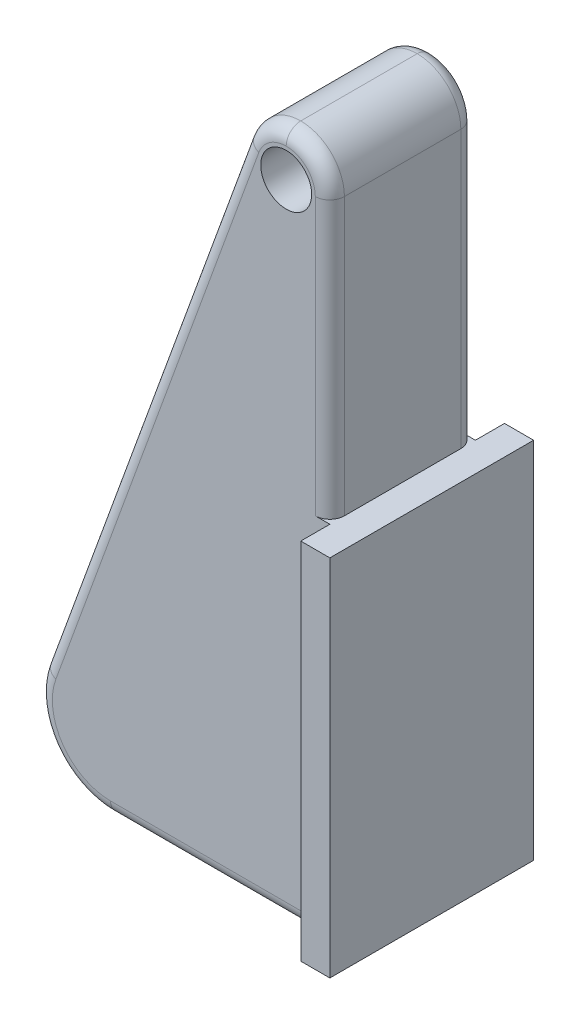
ISO-10303-21;
HEADER;
FILE_DESCRIPTION(('STEP AP214'),'2;1');
FILE_NAME('part.step','',(''),(''),'','','');
FILE_SCHEMA(('AUTOMOTIVE_DESIGN { 1 0 10303 214 1 1 1 1 }'));
ENDSEC;
DATA;
#1=APPLICATION_CONTEXT('core data for automotive mechanical design processes');
#2=APPLICATION_PROTOCOL_DEFINITION('international standard','automotive_design',2000,#1);
#3=PRODUCT_CONTEXT('',#1,'mechanical');
#4=PRODUCT('Part','Part','',(#3));
#5=PRODUCT_RELATED_PRODUCT_CATEGORY('part','',(#4));
#6=PRODUCT_DEFINITION_FORMATION('','',#4);
#7=PRODUCT_DEFINITION_CONTEXT('part definition',#1,'design');
#8=PRODUCT_DEFINITION('design','',#6,#7);
#9=PRODUCT_DEFINITION_SHAPE('','',#8);
#10=(LENGTH_UNIT() NAMED_UNIT(*) SI_UNIT(.MILLI.,.METRE.));
#11=(NAMED_UNIT(*) PLANE_ANGLE_UNIT() SI_UNIT($,.RADIAN.));
#12=(NAMED_UNIT(*) SI_UNIT($,.STERADIAN.) SOLID_ANGLE_UNIT());
#13=UNCERTAINTY_MEASURE_WITH_UNIT(LENGTH_MEASURE(1.E-05),#10,'distance_accuracy_value','');
#14=(GEOMETRIC_REPRESENTATION_CONTEXT(3) GLOBAL_UNCERTAINTY_ASSIGNED_CONTEXT((#13)) GLOBAL_UNIT_ASSIGNED_CONTEXT((#10,
#11,#12)) REPRESENTATION_CONTEXT('',''));
#15=CARTESIAN_POINT('',(0.,0.,0.));
#16=DIRECTION('',(0.,0.,1.));
#17=DIRECTION('',(1.,0.,0.));
#18=AXIS2_PLACEMENT_3D('',#15,#16,#17);
#19=CARTESIAN_POINT('',(0.,0.,10.));
#20=DIRECTION('',(-1.,0.,0.));
#21=DIRECTION('',(0.,0.,1.));
#22=AXIS2_PLACEMENT_3D('',#19,#20,#21);
#23=PLANE('',#22);
#24=DIRECTION('',(0.,0.,1.));
#25=VECTOR('',#24,1.);
#26=CARTESIAN_POINT('',(0.,25.,12.));
#27=LINE('',#26,#25);
#28=CARTESIAN_POINT('',(0.,25.,0.999999999999999));
#29=VERTEX_POINT('',#28);
#30=CARTESIAN_POINT('',(0.,25.,9.));
#31=VERTEX_POINT('',#30);
#32=EDGE_CURVE('E213',#29,#31,#27,.T.);
#33=ORIENTED_EDGE('',*,*,#32,.F.);
#34=DIRECTION('',(0.,1.,0.));
#35=VECTOR('',#34,1.);
#36=CARTESIAN_POINT('',(0.,0.,0.999999999999999));
#37=LINE('',#36,#35);
#38=CARTESIAN_POINT('',(0.,44.,0.999999999999999));
#39=VERTEX_POINT('',#38);
#40=EDGE_CURVE('E290',#29,#39,#37,.T.);
#41=ORIENTED_EDGE('',*,*,#40,.T.);
#42=DIRECTION('',(0.,0.,-1.));
#43=VECTOR('',#42,1.);
#44=CARTESIAN_POINT('',(0.,44.,10.));
#45=LINE('',#44,#43);
#46=CARTESIAN_POINT('',(0.,44.,9.));
#47=VERTEX_POINT('',#46);
#48=EDGE_CURVE('E247',#39,#47,#45,.F.);
#49=ORIENTED_EDGE('',*,*,#48,.T.);
#50=DIRECTION('',(0.,1.,0.));
#51=VECTOR('',#50,1.);
#52=CARTESIAN_POINT('',(0.,25.,9.));
#53=LINE('',#52,#51);
#54=EDGE_CURVE('E288',#47,#31,#53,.F.);
#55=ORIENTED_EDGE('',*,*,#54,.T.);
#56=EDGE_LOOP('',(#33,#41,#49,#55));
#57=FACE_BOUND('',#56,.T.);
#58=ADVANCED_FACE('F35',(#57),#23,.F.);
#59=CARTESIAN_POINT('',(0.,0.,10.));
#60=DIRECTION('',(0.,0.,1.));
#61=DIRECTION('',(1.,0.,0.));
#62=AXIS2_PLACEMENT_3D('',#59,#60,#61);
#63=PLANE('',#62);
#64=DIRECTION('',(0.,1.,0.));
#65=VECTOR('',#64,1.);
#66=CARTESIAN_POINT('',(0.,0.,10.));
#67=LINE('',#66,#65);
#68=CARTESIAN_POINT('',(0.,1.,10.));
#69=VERTEX_POINT('',#68);
#70=CARTESIAN_POINT('',(0.,25.,10.));
#71=VERTEX_POINT('',#70);
#72=EDGE_CURVE('E229',#69,#71,#67,.T.);
#73=ORIENTED_EDGE('',*,*,#72,.T.);
#74=DIRECTION('',(-1.,0.,0.));
#75=VECTOR('',#74,1.);
#76=CARTESIAN_POINT('',(2.,25.,10.));
#77=LINE('',#76,#75);
#78=CARTESIAN_POINT('',(-1.,25.,10.));
#79=VERTEX_POINT('',#78);
#80=EDGE_CURVE('E52',#71,#79,#77,.T.);
#81=ORIENTED_EDGE('',*,*,#80,.T.);
#82=DIRECTION('',(0.,1.,0.));
#83=VECTOR('',#82,1.);
#84=CARTESIAN_POINT('',(-1.,44.,10.));
#85=LINE('',#84,#83);
#86=CARTESIAN_POINT('',(-1.,44.,10.));
#87=VERTEX_POINT('',#86);
#88=EDGE_CURVE('E302',#79,#87,#85,.T.);
#89=ORIENTED_EDGE('',*,*,#88,.T.);
#90=CARTESIAN_POINT('',(-3.,44.,10.));
#91=DIRECTION('',(0.,0.,1.));
#92=DIRECTION('',(1.,0.,0.));
#93=AXIS2_PLACEMENT_3D('',#90,#91,#92);
#94=CIRCLE('',#93,2.);
#95=CARTESIAN_POINT('',(-3.,46.,10.));
#96=VERTEX_POINT('',#95);
#97=EDGE_CURVE('E300',#87,#96,#94,.T.);
#98=ORIENTED_EDGE('',*,*,#97,.T.);
#99=CARTESIAN_POINT('',(-3.,44.,10.));
#100=DIRECTION('',(0.,0.,1.));
#101=DIRECTION('',(1.,0.,0.));
#102=AXIS2_PLACEMENT_3D('',#99,#100,#101);
#103=CIRCLE('',#102,2.);
#104=CARTESIAN_POINT('',(-4.87938524157182,44.6840402866513,10.));
#105=VERTEX_POINT('',#104);
#106=EDGE_CURVE('E296',#96,#105,#103,.T.);
#107=ORIENTED_EDGE('',*,*,#106,.T.);
#108=DIRECTION('',(-0.342020143325665,-0.93969262078591,0.));
#109=VECTOR('',#108,1.);
#110=CARTESIAN_POINT('',(-18.8252540745735,6.36808057330267,10.));
#111=LINE('',#110,#109);
#112=CARTESIAN_POINT('',(-18.8252540745735,6.36808057330266,10.));
#113=VERTEX_POINT('',#112);
#114=EDGE_CURVE('E291',#105,#113,#111,.T.);
#115=ORIENTED_EDGE('',*,*,#114,.T.);
#116=CARTESIAN_POINT('',(-15.0664835914299,5.,10.));
#117=DIRECTION('',(0.,0.,1.));
#118=DIRECTION('',(1.,0.,0.));
#119=AXIS2_PLACEMENT_3D('',#116,#117,#118);
#120=CIRCLE('',#119,4.);
#121=CARTESIAN_POINT('',(-15.0664835914299,1.,10.));
#122=VERTEX_POINT('',#121);
#123=EDGE_CURVE('E294',#113,#122,#120,.T.);
#124=ORIENTED_EDGE('',*,*,#123,.T.);
#125=DIRECTION('',(1.,0.,0.));
#126=VECTOR('',#125,1.);
#127=CARTESIAN_POINT('',(0.,1.,10.));
#128=LINE('',#127,#126);
#129=EDGE_CURVE('E298',#122,#69,#128,.T.);
#130=ORIENTED_EDGE('',*,*,#129,.T.);
#131=EDGE_LOOP('',(#73,#81,#89,#98,#107,#115,#124,#130));
#132=FACE_BOUND('',#131,.T.);
#133=CARTESIAN_POINT('',(-3.,44.,10.));
#134=DIRECTION('',(0.,0.,1.));
#135=DIRECTION('',(1.,0.,0.));
#136=AXIS2_PLACEMENT_3D('',#133,#134,#135);
#137=CIRCLE('',#136,1.75);
#138=CARTESIAN_POINT('',(-1.25,44.,10.));
#139=VERTEX_POINT('',#138);
#140=EDGE_CURVE('E193',#139,#139,#137,.T.);
#141=ORIENTED_EDGE('',*,*,#140,.F.);
#142=EDGE_LOOP('',(#141));
#143=FACE_BOUND('',#142,.T.);
#144=ADVANCED_FACE('F360',(#132,#143),#63,.T.);
#145=CARTESIAN_POINT('',(0.,0.,0.));
#146=DIRECTION('',(0.,0.,1.));
#147=DIRECTION('',(1.,0.,0.));
#148=AXIS2_PLACEMENT_3D('',#145,#146,#147);
#149=PLANE('',#148);
#150=DIRECTION('',(0.,1.,0.));
#151=VECTOR('',#150,1.);
#152=CARTESIAN_POINT('',(-1.,0.,0.));
#153=LINE('',#152,#151);
#154=CARTESIAN_POINT('',(-1.,44.,0.));
#155=VERTEX_POINT('',#154);
#156=CARTESIAN_POINT('',(-1.,25.,0.));
#157=VERTEX_POINT('',#156);
#158=EDGE_CURVE('E275',#155,#157,#153,.F.);
#159=ORIENTED_EDGE('',*,*,#158,.T.);
#160=DIRECTION('',(1.,0.,0.));
#161=VECTOR('',#160,1.);
#162=CARTESIAN_POINT('',(0.,25.,0.));
#163=LINE('',#162,#161);
#164=CARTESIAN_POINT('',(0.,25.,0.));
#165=VERTEX_POINT('',#164);
#166=EDGE_CURVE('E278',#157,#165,#163,.T.);
#167=ORIENTED_EDGE('',*,*,#166,.T.);
#168=DIRECTION('',(0.,1.,0.));
#169=VECTOR('',#168,1.);
#170=CARTESIAN_POINT('',(0.,0.,0.));
#171=LINE('',#170,#169);
#172=CARTESIAN_POINT('',(0.,1.,0.));
#173=VERTEX_POINT('',#172);
#174=EDGE_CURVE('E225',#173,#165,#171,.T.);
#175=ORIENTED_EDGE('',*,*,#174,.F.);
#176=DIRECTION('',(1.,0.,0.));
#177=VECTOR('',#176,1.);
#178=CARTESIAN_POINT('',(0.,1.,0.));
#179=LINE('',#178,#177);
#180=CARTESIAN_POINT('',(-15.0664835914299,1.,0.));
#181=VERTEX_POINT('',#180);
#182=EDGE_CURVE('E269',#173,#181,#179,.F.);
#183=ORIENTED_EDGE('',*,*,#182,.T.);
#184=CARTESIAN_POINT('',(-15.0664835914299,5.,0.));
#185=DIRECTION('',(0.,0.,1.));
#186=DIRECTION('',(1.,0.,0.));
#187=AXIS2_PLACEMENT_3D('',#184,#185,#186);
#188=CIRCLE('',#187,4.);
#189=CARTESIAN_POINT('',(-18.8252540745735,6.36808057330266,0.));
#190=VERTEX_POINT('',#189);
#191=EDGE_CURVE('E262',#181,#190,#188,.F.);
#192=ORIENTED_EDGE('',*,*,#191,.T.);
#193=DIRECTION('',(-0.342020143325665,-0.93969262078591,0.));
#194=VECTOR('',#193,1.);
#195=CARTESIAN_POINT('',(-18.669779319354,6.79524395256349,0.));
#196=LINE('',#195,#194);
#197=CARTESIAN_POINT('',(-4.87938524157182,44.6840402866513,0.));
#198=VERTEX_POINT('',#197);
#199=EDGE_CURVE('E238',#190,#198,#196,.F.);
#200=ORIENTED_EDGE('',*,*,#199,.T.);
#201=CARTESIAN_POINT('',(-3.,44.,0.));
#202=DIRECTION('',(0.,0.,1.));
#203=DIRECTION('',(1.,0.,0.));
#204=AXIS2_PLACEMENT_3D('',#201,#202,#203);
#205=CIRCLE('',#204,2.);
#206=CARTESIAN_POINT('',(-3.,46.,0.));
#207=VERTEX_POINT('',#206);
#208=EDGE_CURVE('E266',#198,#207,#205,.F.);
#209=ORIENTED_EDGE('',*,*,#208,.T.);
#210=CARTESIAN_POINT('',(-3.,44.,0.));
#211=DIRECTION('',(0.,0.,1.));
#212=DIRECTION('',(1.,0.,0.));
#213=AXIS2_PLACEMENT_3D('',#210,#211,#212);
#214=CIRCLE('',#213,2.);
#215=EDGE_CURVE('E273',#207,#155,#214,.F.);
#216=ORIENTED_EDGE('',*,*,#215,.T.);
#217=EDGE_LOOP('',(#159,#167,#175,#183,#192,#200,#209,#216));
#218=FACE_BOUND('',#217,.T.);
#219=CARTESIAN_POINT('',(-3.,44.,0.));
#220=DIRECTION('',(0.,0.,1.));
#221=DIRECTION('',(1.,0.,0.));
#222=AXIS2_PLACEMENT_3D('',#219,#220,#221);
#223=CIRCLE('',#222,1.75);
#224=CARTESIAN_POINT('',(-1.25,44.,0.));
#225=VERTEX_POINT('',#224);
#226=EDGE_CURVE('E190',#225,#225,#223,.T.);
#227=ORIENTED_EDGE('',*,*,#226,.T.);
#228=EDGE_LOOP('',(#227));
#229=FACE_BOUND('',#228,.T.);
#230=ADVANCED_FACE('F433',(#218,#229),#149,.F.);
#231=CARTESIAN_POINT('',(-22.2072236251404,0.,10.));
#232=DIRECTION('',(0.,1.,0.));
#233=DIRECTION('',(-1.,0.,0.));
#234=AXIS2_PLACEMENT_3D('',#231,#232,#233);
#235=PLANE('',#234);
#236=DIRECTION('',(0.,0.,-1.));
#237=VECTOR('',#236,1.);
#238=CARTESIAN_POINT('',(0.,0.,12.));
#239=LINE('',#238,#237);
#240=CARTESIAN_POINT('',(0.,0.,12.));
#241=VERTEX_POINT('',#240);
#242=CARTESIAN_POINT('',(0.,0.,9.));
#243=VERTEX_POINT('',#242);
#244=EDGE_CURVE('E60',#241,#243,#239,.T.);
#245=ORIENTED_EDGE('',*,*,#244,.T.);
#246=DIRECTION('',(1.,0.,0.));
#247=VECTOR('',#246,1.);
#248=CARTESIAN_POINT('',(-15.0664835914299,0.,9.));
#249=LINE('',#248,#247);
#250=CARTESIAN_POINT('',(-15.0664835914299,0.,9.));
#251=VERTEX_POINT('',#250);
#252=EDGE_CURVE('E312',#243,#251,#249,.F.);
#253=ORIENTED_EDGE('',*,*,#252,.T.);
#254=DIRECTION('',(0.,0.,-1.));
#255=VECTOR('',#254,1.);
#256=CARTESIAN_POINT('',(-15.0664835914299,0.,10.));
#257=LINE('',#256,#255);
#258=CARTESIAN_POINT('',(-15.0664835914299,0.,0.999999999999999));
#259=VERTEX_POINT('',#258);
#260=EDGE_CURVE('E250',#251,#259,#257,.T.);
#261=ORIENTED_EDGE('',*,*,#260,.T.);
#262=DIRECTION('',(1.,0.,0.));
#263=VECTOR('',#262,1.);
#264=CARTESIAN_POINT('',(-22.2072236251404,0.,0.999999999999999));
#265=LINE('',#264,#263);
#266=CARTESIAN_POINT('',(0.,0.,0.999999999999999));
#267=VERTEX_POINT('',#266);
#268=EDGE_CURVE('E310',#259,#267,#265,.T.);
#269=ORIENTED_EDGE('',*,*,#268,.T.);
#270=CARTESIAN_POINT('',(0.,0.,-2.));
#271=VERTEX_POINT('',#270);
#272=EDGE_CURVE('E202',#267,#271,#239,.T.);
#273=ORIENTED_EDGE('',*,*,#272,.T.);
#274=DIRECTION('',(-1.,0.,0.));
#275=VECTOR('',#274,1.);
#276=CARTESIAN_POINT('',(2.,0.,-2.));
#277=LINE('',#276,#275);
#278=CARTESIAN_POINT('',(2.,0.,-2.));
#279=VERTEX_POINT('',#278);
#280=EDGE_CURVE('E172',#279,#271,#277,.T.);
#281=ORIENTED_EDGE('',*,*,#280,.F.);
#282=DIRECTION('',(0.,0.,-1.));
#283=VECTOR('',#282,1.);
#284=CARTESIAN_POINT('',(2.,0.,12.));
#285=LINE('',#284,#283);
#286=CARTESIAN_POINT('',(2.,0.,12.));
#287=VERTEX_POINT('',#286);
#288=EDGE_CURVE('E165',#287,#279,#285,.T.);
#289=ORIENTED_EDGE('',*,*,#288,.F.);
#290=DIRECTION('',(-1.,0.,0.));
#291=VECTOR('',#290,1.);
#292=CARTESIAN_POINT('',(2.,0.,12.));
#293=LINE('',#292,#291);
#294=EDGE_CURVE('E169',#287,#241,#293,.T.);
#295=ORIENTED_EDGE('',*,*,#294,.T.);
#296=EDGE_LOOP('',(#245,#253,#261,#269,#273,#281,#289,#295));
#297=FACE_BOUND('',#296,.T.);
#298=ADVANCED_FACE('F167',(#297),#235,.F.);
#299=CARTESIAN_POINT('',(-5.10062261462914,47.,10.));
#300=DIRECTION('',(0.93969262078591,-0.342020143325665,0.));
#301=DIRECTION('',(0.342020143325665,0.93969262078591,0.));
#302=AXIS2_PLACEMENT_3D('',#299,#300,#301);
#303=PLANE('',#302);
#304=DIRECTION('',(0.,0.,-1.));
#305=VECTOR('',#304,1.);
#306=CARTESIAN_POINT('',(-5.81907786235773,45.026060429977,10.));
#307=LINE('',#306,#305);
#308=CARTESIAN_POINT('',(-5.81907786235773,45.026060429977,9.));
#309=VERTEX_POINT('',#308);
#310=CARTESIAN_POINT('',(-5.81907786235773,45.026060429977,0.999999999999999));
#311=VERTEX_POINT('',#310);
#312=EDGE_CURVE('E244',#309,#311,#307,.T.);
#313=ORIENTED_EDGE('',*,*,#312,.T.);
#314=DIRECTION('',(-0.342020143325665,-0.93969262078591,0.));
#315=VECTOR('',#314,1.);
#316=CARTESIAN_POINT('',(-5.10062261462914,47.,0.999999999999999));
#317=LINE('',#316,#315);
#318=CARTESIAN_POINT('',(-19.7649466953594,6.71010071662832,0.999999999999999));
#319=VERTEX_POINT('',#318);
#320=EDGE_CURVE('E316',#311,#319,#317,.T.);
#321=ORIENTED_EDGE('',*,*,#320,.T.);
#322=DIRECTION('',(0.,0.,-1.));
#323=VECTOR('',#322,1.);
#324=CARTESIAN_POINT('',(-19.7649466953594,6.71010071662832,10.));
#325=LINE('',#324,#323);
#326=CARTESIAN_POINT('',(-19.7649466953594,6.71010071662832,9.));
#327=VERTEX_POINT('',#326);
#328=EDGE_CURVE('E236',#319,#327,#325,.F.);
#329=ORIENTED_EDGE('',*,*,#328,.T.);
#330=DIRECTION('',(-0.342020143325665,-0.93969262078591,0.));
#331=VECTOR('',#330,1.);
#332=CARTESIAN_POINT('',(-5.81907786235772,45.026060429977,9.));
#333=LINE('',#332,#331);
#334=EDGE_CURVE('E314',#327,#309,#333,.F.);
#335=ORIENTED_EDGE('',*,*,#334,.T.);
#336=EDGE_LOOP('',(#313,#321,#329,#335));
#337=FACE_BOUND('',#336,.T.);
#338=ADVANCED_FACE('F409',(#337),#303,.F.);
#339=CARTESIAN_POINT('',(-3.,44.,10.));
#340=DIRECTION('',(0.,0.,-1.));
#341=DIRECTION('',(-1.,0.,0.));
#342=AXIS2_PLACEMENT_3D('',#339,#340,#341);
#343=CYLINDRICAL_SURFACE('',#342,1.75);
#344=ORIENTED_EDGE('',*,*,#140,.T.);
#345=EDGE_LOOP('',(#344));
#346=FACE_BOUND('',#345,.T.);
#347=ORIENTED_EDGE('',*,*,#226,.F.);
#348=EDGE_LOOP('',(#347));
#349=FACE_BOUND('',#348,.T.);
#350=ADVANCED_FACE('F534',(#346,#349),#343,.F.);
#351=CARTESIAN_POINT('',(0.,0.,0.));
#352=DIRECTION('',(1.,0.,0.));
#353=DIRECTION('',(0.,0.,-1.));
#354=AXIS2_PLACEMENT_3D('',#351,#352,#353);
#355=PLANE('',#354);
#356=ORIENTED_EDGE('',*,*,#272,.F.);
#357=CARTESIAN_POINT('',(0.,1.,0.999999999999999));
#358=DIRECTION('',(1.,0.,0.));
#359=DIRECTION('',(0.,0.,-1.));
#360=AXIS2_PLACEMENT_3D('',#357,#358,#359);
#361=CIRCLE('',#360,1.);
#362=EDGE_CURVE('E11',#267,#173,#361,.T.);
#363=ORIENTED_EDGE('',*,*,#362,.T.);
#364=ORIENTED_EDGE('',*,*,#174,.T.);
#365=CARTESIAN_POINT('',(0.,25.,-2.));
#366=VERTEX_POINT('',#365);
#367=EDGE_CURVE('E185',#366,#165,#27,.T.);
#368=ORIENTED_EDGE('',*,*,#367,.F.);
#369=DIRECTION('',(0.,1.,0.));
#370=VECTOR('',#369,1.);
#371=CARTESIAN_POINT('',(0.,25.,-2.));
#372=LINE('',#371,#370);
#373=EDGE_CURVE('E201',#271,#366,#372,.T.);
#374=ORIENTED_EDGE('',*,*,#373,.F.);
#375=EDGE_LOOP('',(#356,#363,#364,#368,#374));
#376=FACE_BOUND('',#375,.T.);
#377=ADVANCED_FACE('F223',(#376),#355,.F.);
#378=CARTESIAN_POINT('',(2.,25.,12.));
#379=DIRECTION('',(0.,0.,-1.));
#380=DIRECTION('',(0.,1.,0.));
#381=AXIS2_PLACEMENT_3D('',#378,#379,#380);
#382=PLANE('',#381);
#383=DIRECTION('',(0.,-1.,0.));
#384=VECTOR('',#383,1.);
#385=CARTESIAN_POINT('',(0.,25.,12.));
#386=LINE('',#385,#384);
#387=CARTESIAN_POINT('',(0.,25.,12.));
#388=VERTEX_POINT('',#387);
#389=EDGE_CURVE('E189',#388,#241,#386,.T.);
#390=ORIENTED_EDGE('',*,*,#389,.T.);
#391=ORIENTED_EDGE('',*,*,#294,.F.);
#392=DIRECTION('',(0.,-1.,0.));
#393=VECTOR('',#392,1.);
#394=CARTESIAN_POINT('',(2.,25.,12.));
#395=LINE('',#394,#393);
#396=CARTESIAN_POINT('',(2.,25.,12.));
#397=VERTEX_POINT('',#396);
#398=EDGE_CURVE('E176',#397,#287,#395,.T.);
#399=ORIENTED_EDGE('',*,*,#398,.F.);
#400=DIRECTION('',(-1.,0.,0.));
#401=VECTOR('',#400,1.);
#402=CARTESIAN_POINT('',(2.,25.,12.));
#403=LINE('',#402,#401);
#404=EDGE_CURVE('E214',#397,#388,#403,.T.);
#405=ORIENTED_EDGE('',*,*,#404,.T.);
#406=EDGE_LOOP('',(#390,#391,#399,#405));
#407=FACE_BOUND('',#406,.T.);
#408=ADVANCED_FACE('F187',(#407),#382,.F.);
#409=CARTESIAN_POINT('',(2.,25.,-2.));
#410=DIRECTION('',(0.,0.,1.));
#411=DIRECTION('',(0.,-1.,0.));
#412=AXIS2_PLACEMENT_3D('',#409,#410,#411);
#413=PLANE('',#412);
#414=ORIENTED_EDGE('',*,*,#373,.T.);
#415=DIRECTION('',(-1.,0.,0.));
#416=VECTOR('',#415,1.);
#417=CARTESIAN_POINT('',(2.,25.,-2.));
#418=LINE('',#417,#416);
#419=CARTESIAN_POINT('',(2.,25.,-2.));
#420=VERTEX_POINT('',#419);
#421=EDGE_CURVE('E195',#420,#366,#418,.T.);
#422=ORIENTED_EDGE('',*,*,#421,.F.);
#423=DIRECTION('',(0.,1.,0.));
#424=VECTOR('',#423,1.);
#425=CARTESIAN_POINT('',(2.,25.,-2.));
#426=LINE('',#425,#424);
#427=EDGE_CURVE('E175',#279,#420,#426,.T.);
#428=ORIENTED_EDGE('',*,*,#427,.F.);
#429=ORIENTED_EDGE('',*,*,#280,.T.);
#430=EDGE_LOOP('',(#414,#422,#428,#429));
#431=FACE_BOUND('',#430,.T.);
#432=ADVANCED_FACE('F418',(#431),#413,.F.);
#433=CARTESIAN_POINT('',(2.,25.,12.));
#434=DIRECTION('',(0.,-1.,0.));
#435=DIRECTION('',(0.,0.,-1.));
#436=AXIS2_PLACEMENT_3D('',#433,#434,#435);
#437=PLANE('',#436);
#438=ORIENTED_EDGE('',*,*,#367,.T.);
#439=ORIENTED_EDGE('',*,*,#166,.F.);
#440=CARTESIAN_POINT('',(-1.,25.,0.999999999999999));
#441=DIRECTION('',(0.,-1.,0.));
#442=DIRECTION('',(0.,0.,-1.));
#443=AXIS2_PLACEMENT_3D('',#440,#441,#442);
#444=CIRCLE('',#443,1.);
#445=EDGE_CURVE('E318',#157,#29,#444,.T.);
#446=ORIENTED_EDGE('',*,*,#445,.T.);
#447=ORIENTED_EDGE('',*,*,#32,.T.);
#448=CARTESIAN_POINT('',(-1.,25.,9.));
#449=DIRECTION('',(0.,-1.,0.));
#450=DIRECTION('',(0.,0.,-1.));
#451=AXIS2_PLACEMENT_3D('',#448,#449,#450);
#452=CIRCLE('',#451,1.);
#453=EDGE_CURVE('E320',#31,#79,#452,.T.);
#454=ORIENTED_EDGE('',*,*,#453,.T.);
#455=ORIENTED_EDGE('',*,*,#80,.F.);
#456=EDGE_CURVE('E210',#71,#388,#27,.T.);
#457=ORIENTED_EDGE('',*,*,#456,.T.);
#458=ORIENTED_EDGE('',*,*,#404,.F.);
#459=DIRECTION('',(0.,0.,1.));
#460=VECTOR('',#459,1.);
#461=CARTESIAN_POINT('',(2.,25.,12.));
#462=LINE('',#461,#460);
#463=EDGE_CURVE('E181',#420,#397,#462,.T.);
#464=ORIENTED_EDGE('',*,*,#463,.F.);
#465=ORIENTED_EDGE('',*,*,#421,.T.);
#466=EDGE_LOOP('',(#438,#439,#446,#447,#454,#455,#457,#458,#464,#465));
#467=FACE_BOUND('',#466,.T.);
#468=ADVANCED_FACE('F218',(#467),#437,.F.);
#469=CARTESIAN_POINT('',(2.,0.,0.));
#470=DIRECTION('',(1.,0.,0.));
#471=DIRECTION('',(0.,0.,-1.));
#472=AXIS2_PLACEMENT_3D('',#469,#470,#471);
#473=PLANE('',#472);
#474=ORIENTED_EDGE('',*,*,#398,.T.);
#475=ORIENTED_EDGE('',*,*,#288,.T.);
#476=ORIENTED_EDGE('',*,*,#427,.T.);
#477=ORIENTED_EDGE('',*,*,#463,.T.);
#478=EDGE_LOOP('',(#474,#475,#476,#477));
#479=FACE_BOUND('',#478,.T.);
#480=ADVANCED_FACE('F179',(#479),#473,.T.);
#481=ORIENTED_EDGE('',*,*,#72,.F.);
#482=CARTESIAN_POINT('',(0.,1.,9.));
#483=DIRECTION('',(1.,0.,0.));
#484=DIRECTION('',(0.,0.,-1.));
#485=AXIS2_PLACEMENT_3D('',#482,#483,#484);
#486=CIRCLE('',#485,1.);
#487=EDGE_CURVE('E44',#69,#243,#486,.T.);
#488=ORIENTED_EDGE('',*,*,#487,.T.);
#489=ORIENTED_EDGE('',*,*,#244,.F.);
#490=ORIENTED_EDGE('',*,*,#389,.F.);
#491=ORIENTED_EDGE('',*,*,#456,.F.);
#492=EDGE_LOOP('',(#481,#488,#489,#490,#491));
#493=FACE_BOUND('',#492,.T.);
#494=ADVANCED_FACE('F364',(#493),#355,.F.);
#495=CARTESIAN_POINT('',(-3.,44.,10.));
#496=DIRECTION('',(0.,0.,-1.));
#497=DIRECTION('',(-1.,0.,0.));
#498=AXIS2_PLACEMENT_3D('',#495,#496,#497);
#499=CYLINDRICAL_SURFACE('',#498,3.);
#500=ORIENTED_EDGE('',*,*,#48,.F.);
#501=CARTESIAN_POINT('',(-3.,44.,0.999999999999999));
#502=DIRECTION('',(0.,0.,1.));
#503=DIRECTION('',(1.,0.,0.));
#504=AXIS2_PLACEMENT_3D('',#501,#502,#503);
#505=CIRCLE('',#504,3.);
#506=CARTESIAN_POINT('',(-3.,47.,0.999999999999999));
#507=VERTEX_POINT('',#506);
#508=EDGE_CURVE('E286',#39,#507,#505,.T.);
#509=ORIENTED_EDGE('',*,*,#508,.T.);
#510=DIRECTION('',(0.,0.,-1.));
#511=VECTOR('',#510,1.);
#512=CARTESIAN_POINT('',(-3.,47.,10.));
#513=LINE('',#512,#511);
#514=CARTESIAN_POINT('',(-3.,47.,9.));
#515=VERTEX_POINT('',#514);
#516=EDGE_CURVE('E251',#515,#507,#513,.T.);
#517=ORIENTED_EDGE('',*,*,#516,.F.);
#518=CARTESIAN_POINT('',(-3.,44.,9.));
#519=DIRECTION('',(0.,0.,1.));
#520=DIRECTION('',(1.,0.,0.));
#521=AXIS2_PLACEMENT_3D('',#518,#519,#520);
#522=CIRCLE('',#521,3.);
#523=EDGE_CURVE('E284',#515,#47,#522,.F.);
#524=ORIENTED_EDGE('',*,*,#523,.T.);
#525=EDGE_LOOP('',(#500,#509,#517,#524));
#526=FACE_BOUND('',#525,.T.);
#527=ADVANCED_FACE('F389',(#526),#499,.T.);
#528=CARTESIAN_POINT('',(-3.,44.,10.));
#529=DIRECTION('',(0.,0.,-1.));
#530=DIRECTION('',(-1.,0.,0.));
#531=AXIS2_PLACEMENT_3D('',#528,#529,#530);
#532=CYLINDRICAL_SURFACE('',#531,3.);
#533=ORIENTED_EDGE('',*,*,#516,.T.);
#534=CARTESIAN_POINT('',(-3.,44.,0.999999999999997));
#535=DIRECTION('',(0.,0.,1.));
#536=DIRECTION('',(1.,0.,0.));
#537=AXIS2_PLACEMENT_3D('',#534,#535,#536);
#538=CIRCLE('',#537,3.);
#539=EDGE_CURVE('E282',#507,#311,#538,.T.);
#540=ORIENTED_EDGE('',*,*,#539,.T.);
#541=ORIENTED_EDGE('',*,*,#312,.F.);
#542=CARTESIAN_POINT('',(-3.,44.,9.));
#543=DIRECTION('',(0.,0.,1.));
#544=DIRECTION('',(1.,0.,0.));
#545=AXIS2_PLACEMENT_3D('',#542,#543,#544);
#546=CIRCLE('',#545,3.);
#547=EDGE_CURVE('E280',#309,#515,#546,.F.);
#548=ORIENTED_EDGE('',*,*,#547,.T.);
#549=EDGE_LOOP('',(#533,#540,#541,#548));
#550=FACE_BOUND('',#549,.T.);
#551=ADVANCED_FACE('F401',(#550),#532,.T.);
#552=CARTESIAN_POINT('',(-15.0664835914299,5.,10.));
#553=DIRECTION('',(0.,0.,-1.));
#554=DIRECTION('',(-1.,0.,0.));
#555=AXIS2_PLACEMENT_3D('',#552,#553,#554);
#556=CYLINDRICAL_SURFACE('',#555,5.);
#557=ORIENTED_EDGE('',*,*,#328,.F.);
#558=CARTESIAN_POINT('',(-15.0664835914299,5.,0.999999999999999));
#559=DIRECTION('',(0.,0.,1.));
#560=DIRECTION('',(1.,0.,0.));
#561=AXIS2_PLACEMENT_3D('',#558,#559,#560);
#562=CIRCLE('',#561,5.);
#563=EDGE_CURVE('E308',#319,#259,#562,.T.);
#564=ORIENTED_EDGE('',*,*,#563,.T.);
#565=ORIENTED_EDGE('',*,*,#260,.F.);
#566=CARTESIAN_POINT('',(-15.0664835914299,5.,9.));
#567=DIRECTION('',(0.,0.,1.));
#568=DIRECTION('',(1.,0.,0.));
#569=AXIS2_PLACEMENT_3D('',#566,#567,#568);
#570=CIRCLE('',#569,5.);
#571=EDGE_CURVE('E306',#251,#327,#570,.F.);
#572=ORIENTED_EDGE('',*,*,#571,.T.);
#573=EDGE_LOOP('',(#557,#564,#565,#572));
#574=FACE_BOUND('',#573,.T.);
#575=ADVANCED_FACE('F412',(#574),#556,.T.);
#576=CARTESIAN_POINT('',(-22.2072236251404,1.,0.999999999999999));
#577=DIRECTION('',(1.,0.,0.));
#578=DIRECTION('',(0.,1.,0.));
#579=AXIS2_PLACEMENT_3D('',#576,#577,#578);
#580=CYLINDRICAL_SURFACE('',#579,1.);
#581=ORIENTED_EDGE('',*,*,#362,.F.);
#582=ORIENTED_EDGE('',*,*,#268,.F.);
#583=CARTESIAN_POINT('',(-15.0664835914299,1.,1.));
#584=DIRECTION('',(-1.,0.,0.));
#585=DIRECTION('',(0.,0.,1.));
#586=AXIS2_PLACEMENT_3D('',#583,#584,#585);
#587=CIRCLE('',#586,1.);
#588=EDGE_CURVE('E253',#181,#259,#587,.T.);
#589=ORIENTED_EDGE('',*,*,#588,.F.);
#590=ORIENTED_EDGE('',*,*,#182,.F.);
#591=EDGE_LOOP('',(#581,#582,#589,#590));
#592=FACE_BOUND('',#591,.T.);
#593=ADVANCED_FACE('F417',(#592),#580,.T.);
#594=CARTESIAN_POINT('',(-15.0664835914299,5.,0.999999999999999));
#595=DIRECTION('',(0.,0.,1.));
#596=DIRECTION('',(1.,0.,0.));
#597=AXIS2_PLACEMENT_3D('',#594,#595,#596);
#598=TOROIDAL_SURFACE('',#597,4.,1.);
#599=ORIENTED_EDGE('',*,*,#588,.T.);
#600=ORIENTED_EDGE('',*,*,#563,.F.);
#601=CARTESIAN_POINT('',(-18.8252540745735,6.36808057330266,1.));
#602=DIRECTION('',(0.342020143325665,0.93969262078591,0.));
#603=DIRECTION('',(-0.93969262078591,0.342020143325665,0.));
#604=AXIS2_PLACEMENT_3D('',#601,#602,#603);
#605=CIRCLE('',#604,1.);
#606=EDGE_CURVE('E331',#190,#319,#605,.T.);
#607=ORIENTED_EDGE('',*,*,#606,.F.);
#608=ORIENTED_EDGE('',*,*,#191,.F.);
#609=EDGE_LOOP('',(#599,#600,#607,#608));
#610=FACE_BOUND('',#609,.T.);
#611=ADVANCED_FACE('F414',(#610),#598,.T.);
#612=CARTESIAN_POINT('',(-1.,0.,0.999999999999999));
#613=DIRECTION('',(0.,1.,0.));
#614=DIRECTION('',(0.,0.,1.));
#615=AXIS2_PLACEMENT_3D('',#612,#613,#614);
#616=CYLINDRICAL_SURFACE('',#615,1.);
#617=ORIENTED_EDGE('',*,*,#445,.F.);
#618=ORIENTED_EDGE('',*,*,#158,.F.);
#619=CARTESIAN_POINT('',(-1.,44.,0.999999999999999));
#620=DIRECTION('',(0.,1.,0.));
#621=DIRECTION('',(0.,0.,1.));
#622=AXIS2_PLACEMENT_3D('',#619,#620,#621);
#623=CIRCLE('',#622,1.);
#624=EDGE_CURVE('E328',#39,#155,#623,.T.);
#625=ORIENTED_EDGE('',*,*,#624,.F.);
#626=ORIENTED_EDGE('',*,*,#40,.F.);
#627=EDGE_LOOP('',(#617,#618,#625,#626));
#628=FACE_BOUND('',#627,.T.);
#629=ADVANCED_FACE('F392',(#628),#616,.T.);
#630=CARTESIAN_POINT('',(-4.16092999384323,46.6579798566743,0.999999999999999));
#631=DIRECTION('',(-0.342020143325665,-0.93969262078591,0.));
#632=DIRECTION('',(0.93969262078591,-0.342020143325665,0.));
#633=AXIS2_PLACEMENT_3D('',#630,#631,#632);
#634=CYLINDRICAL_SURFACE('',#633,1.);
#635=ORIENTED_EDGE('',*,*,#606,.T.);
#636=ORIENTED_EDGE('',*,*,#320,.F.);
#637=CARTESIAN_POINT('',(-4.87938524157182,44.6840402866513,1.));
#638=DIRECTION('',(0.342020143325663,0.93969262078591,0.));
#639=DIRECTION('',(-0.939692620785911,0.342020143325663,0.));
#640=AXIS2_PLACEMENT_3D('',#637,#638,#639);
#641=CIRCLE('',#640,1.);
#642=EDGE_CURVE('E325',#198,#311,#641,.T.);
#643=ORIENTED_EDGE('',*,*,#642,.F.);
#644=ORIENTED_EDGE('',*,*,#199,.F.);
#645=EDGE_LOOP('',(#635,#636,#643,#644));
#646=FACE_BOUND('',#645,.T.);
#647=ADVANCED_FACE('F408',(#646),#634,.T.);
#648=CARTESIAN_POINT('',(-3.,44.,0.999999999999999));
#649=DIRECTION('',(0.,0.,1.));
#650=DIRECTION('',(1.,0.,0.));
#651=AXIS2_PLACEMENT_3D('',#648,#649,#650);
#652=TOROIDAL_SURFACE('',#651,2.,1.);
#653=ORIENTED_EDGE('',*,*,#624,.T.);
#654=ORIENTED_EDGE('',*,*,#215,.F.);
#655=CARTESIAN_POINT('',(-3.,46.,0.999999999999999));
#656=DIRECTION('',(-1.,0.,0.));
#657=DIRECTION('',(0.,0.,1.));
#658=AXIS2_PLACEMENT_3D('',#655,#656,#657);
#659=CIRCLE('',#658,1.);
#660=EDGE_CURVE('E323',#507,#207,#659,.T.);
#661=ORIENTED_EDGE('',*,*,#660,.F.);
#662=ORIENTED_EDGE('',*,*,#508,.F.);
#663=EDGE_LOOP('',(#653,#654,#661,#662));
#664=FACE_BOUND('',#663,.T.);
#665=ADVANCED_FACE('F398',(#664),#652,.T.);
#666=CARTESIAN_POINT('',(-3.,44.,0.999999999999999));
#667=DIRECTION('',(0.,0.,1.));
#668=DIRECTION('',(1.,0.,0.));
#669=AXIS2_PLACEMENT_3D('',#666,#667,#668);
#670=TOROIDAL_SURFACE('',#669,2.,1.);
#671=ORIENTED_EDGE('',*,*,#642,.T.);
#672=ORIENTED_EDGE('',*,*,#539,.F.);
#673=ORIENTED_EDGE('',*,*,#660,.T.);
#674=ORIENTED_EDGE('',*,*,#208,.F.);
#675=EDGE_LOOP('',(#671,#672,#673,#674));
#676=FACE_BOUND('',#675,.T.);
#677=ADVANCED_FACE('F404',(#676),#670,.T.);
#678=CARTESIAN_POINT('',(0.,1.,9.));
#679=DIRECTION('',(-1.,0.,0.));
#680=DIRECTION('',(0.,-1.,0.));
#681=AXIS2_PLACEMENT_3D('',#678,#679,#680);
#682=CYLINDRICAL_SURFACE('',#681,1.);
#683=ORIENTED_EDGE('',*,*,#487,.F.);
#684=ORIENTED_EDGE('',*,*,#129,.F.);
#685=CARTESIAN_POINT('',(-15.0664835914299,1.,9.));
#686=DIRECTION('',(-1.,0.,0.));
#687=DIRECTION('',(0.,0.,1.));
#688=AXIS2_PLACEMENT_3D('',#685,#686,#687);
#689=CIRCLE('',#688,1.);
#690=EDGE_CURVE('E39',#251,#122,#689,.T.);
#691=ORIENTED_EDGE('',*,*,#690,.F.);
#692=ORIENTED_EDGE('',*,*,#252,.F.);
#693=EDGE_LOOP('',(#683,#684,#691,#692));
#694=FACE_BOUND('',#693,.T.);
#695=ADVANCED_FACE('F37',(#694),#682,.T.);
#696=CARTESIAN_POINT('',(-15.0664835914299,5.,9.));
#697=DIRECTION('',(0.,0.,1.));
#698=DIRECTION('',(1.,0.,0.));
#699=AXIS2_PLACEMENT_3D('',#696,#697,#698);
#700=TOROIDAL_SURFACE('',#699,4.,1.);
#701=ORIENTED_EDGE('',*,*,#690,.T.);
#702=ORIENTED_EDGE('',*,*,#123,.F.);
#703=CARTESIAN_POINT('',(-18.8252540745735,6.36808057330266,9.));
#704=DIRECTION('',(0.342020143325664,0.93969262078591,0.));
#705=DIRECTION('',(-0.93969262078591,0.342020143325664,0.));
#706=AXIS2_PLACEMENT_3D('',#703,#704,#705);
#707=CIRCLE('',#706,1.);
#708=EDGE_CURVE('E343',#327,#113,#707,.T.);
#709=ORIENTED_EDGE('',*,*,#708,.F.);
#710=ORIENTED_EDGE('',*,*,#571,.F.);
#711=EDGE_LOOP('',(#701,#702,#709,#710));
#712=FACE_BOUND('',#711,.T.);
#713=ADVANCED_FACE('F353',(#712),#700,.T.);
#714=CARTESIAN_POINT('',(-18.669779319354,6.79524395256349,9.));
#715=DIRECTION('',(0.342020143325665,0.93969262078591,0.));
#716=DIRECTION('',(-0.93969262078591,0.342020143325665,0.));
#717=AXIS2_PLACEMENT_3D('',#714,#715,#716);
#718=CYLINDRICAL_SURFACE('',#717,1.);
#719=ORIENTED_EDGE('',*,*,#708,.T.);
#720=ORIENTED_EDGE('',*,*,#114,.F.);
#721=CARTESIAN_POINT('',(-4.87938524157182,44.6840402866513,9.));
#722=DIRECTION('',(0.342020143325662,0.939692620785911,0.));
#723=DIRECTION('',(-0.939692620785911,0.342020143325662,0.));
#724=AXIS2_PLACEMENT_3D('',#721,#722,#723);
#725=CIRCLE('',#724,1.);
#726=EDGE_CURVE('E341',#309,#105,#725,.T.);
#727=ORIENTED_EDGE('',*,*,#726,.F.);
#728=ORIENTED_EDGE('',*,*,#334,.F.);
#729=EDGE_LOOP('',(#719,#720,#727,#728));
#730=FACE_BOUND('',#729,.T.);
#731=ADVANCED_FACE('F464',(#730),#718,.T.);
#732=CARTESIAN_POINT('',(-3.,44.,9.));
#733=DIRECTION('',(0.,0.,1.));
#734=DIRECTION('',(1.,0.,0.));
#735=AXIS2_PLACEMENT_3D('',#732,#733,#734);
#736=TOROIDAL_SURFACE('',#735,2.,1.);
#737=ORIENTED_EDGE('',*,*,#726,.T.);
#738=ORIENTED_EDGE('',*,*,#106,.F.);
#739=CARTESIAN_POINT('',(-3.,46.,9.));
#740=DIRECTION('',(1.,0.,0.));
#741=DIRECTION('',(0.,1.,0.));
#742=AXIS2_PLACEMENT_3D('',#739,#740,#741);
#743=CIRCLE('',#742,1.);
#744=EDGE_CURVE('E338',#515,#96,#743,.T.);
#745=ORIENTED_EDGE('',*,*,#744,.F.);
#746=ORIENTED_EDGE('',*,*,#547,.F.);
#747=EDGE_LOOP('',(#737,#738,#745,#746));
#748=FACE_BOUND('',#747,.T.);
#749=ADVANCED_FACE('F381',(#748),#736,.T.);
#750=CARTESIAN_POINT('',(-3.,44.,9.));
#751=DIRECTION('',(0.,0.,1.));
#752=DIRECTION('',(1.,0.,0.));
#753=AXIS2_PLACEMENT_3D('',#750,#751,#752);
#754=TOROIDAL_SURFACE('',#753,2.,1.);
#755=ORIENTED_EDGE('',*,*,#744,.T.);
#756=ORIENTED_EDGE('',*,*,#97,.F.);
#757=CARTESIAN_POINT('',(-1.,44.,9.));
#758=DIRECTION('',(0.,-1.,0.));
#759=DIRECTION('',(0.,0.,-1.));
#760=AXIS2_PLACEMENT_3D('',#757,#758,#759);
#761=CIRCLE('',#760,1.);
#762=EDGE_CURVE('E336',#47,#87,#761,.T.);
#763=ORIENTED_EDGE('',*,*,#762,.F.);
#764=ORIENTED_EDGE('',*,*,#523,.F.);
#765=EDGE_LOOP('',(#755,#756,#763,#764));
#766=FACE_BOUND('',#765,.T.);
#767=ADVANCED_FACE('F385',(#766),#754,.T.);
#768=CARTESIAN_POINT('',(-1.,0.,9.));
#769=DIRECTION('',(0.,-1.,0.));
#770=DIRECTION('',(0.,0.,-1.));
#771=AXIS2_PLACEMENT_3D('',#768,#769,#770);
#772=CYLINDRICAL_SURFACE('',#771,1.);
#773=ORIENTED_EDGE('',*,*,#453,.F.);
#774=ORIENTED_EDGE('',*,*,#54,.F.);
#775=ORIENTED_EDGE('',*,*,#762,.T.);
#776=ORIENTED_EDGE('',*,*,#88,.F.);
#777=EDGE_LOOP('',(#773,#774,#775,#776));
#778=FACE_BOUND('',#777,.T.);
#779=ADVANCED_FACE('F374',(#778),#772,.T.);
#780=CLOSED_SHELL('',(#58,#144,#230,#298,#338,#350,#377,#408,#432,#468,#480,#494,#527,#551,#575,
#593,#611,#629,#647,#665,#677,#695,#713,#731,#749,#767,#779));
#781=MANIFOLD_SOLID_BREP('B2',#780);
#782=ADVANCED_BREP_SHAPE_REPRESENTATION('',(#18,#781),#14);
#783=SHAPE_DEFINITION_REPRESENTATION(#9,#782);
ENDSEC;
END-ISO-10303-21;
